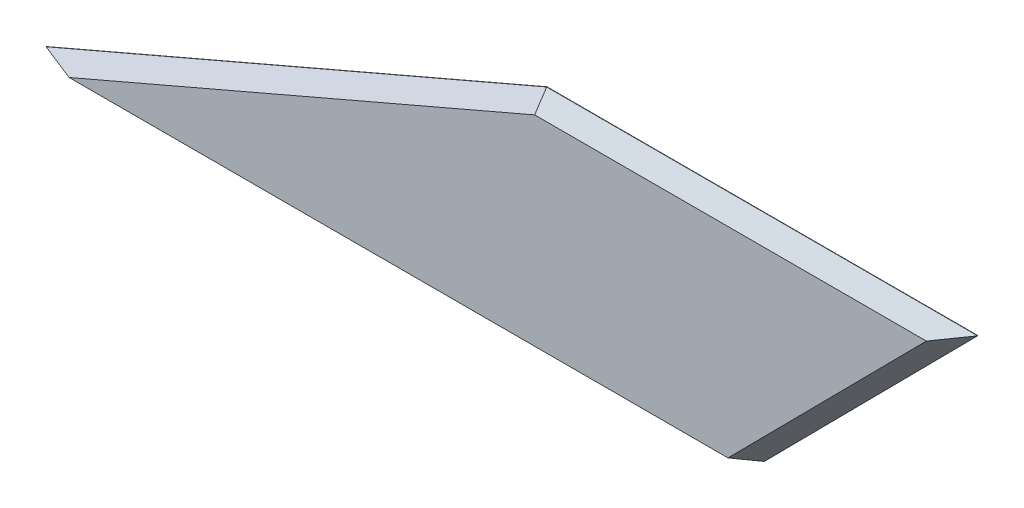
ISO-10303-21;
HEADER;
FILE_DESCRIPTION(('STEP AP214'),'2;1');
FILE_NAME('part.step','',(''),(''),'','','');
FILE_SCHEMA(('AUTOMOTIVE_DESIGN { 1 0 10303 214 1 1 1 1 }'));
ENDSEC;
DATA;
#1=APPLICATION_CONTEXT('core data for automotive mechanical design processes');
#2=APPLICATION_PROTOCOL_DEFINITION('international standard','automotive_design',2000,#1);
#3=PRODUCT_CONTEXT('',#1,'mechanical');
#4=PRODUCT('Part','Part','',(#3));
#5=PRODUCT_RELATED_PRODUCT_CATEGORY('part','',(#4));
#6=PRODUCT_DEFINITION_FORMATION('','',#4);
#7=PRODUCT_DEFINITION_CONTEXT('part definition',#1,'design');
#8=PRODUCT_DEFINITION('design','',#6,#7);
#9=PRODUCT_DEFINITION_SHAPE('','',#8);
#10=(LENGTH_UNIT() NAMED_UNIT(*) SI_UNIT(.MILLI.,.METRE.));
#11=(NAMED_UNIT(*) PLANE_ANGLE_UNIT() SI_UNIT($,.RADIAN.));
#12=(NAMED_UNIT(*) SI_UNIT($,.STERADIAN.) SOLID_ANGLE_UNIT());
#13=UNCERTAINTY_MEASURE_WITH_UNIT(LENGTH_MEASURE(1.E-05),#10,'distance_accuracy_value','');
#14=(GEOMETRIC_REPRESENTATION_CONTEXT(3) GLOBAL_UNCERTAINTY_ASSIGNED_CONTEXT((#13)) GLOBAL_UNIT_ASSIGNED_CONTEXT((#10,
#11,#12)) REPRESENTATION_CONTEXT('',''));
#15=CARTESIAN_POINT('',(0.,0.,0.));
#16=DIRECTION('',(0.,0.,1.));
#17=DIRECTION('',(1.,0.,0.));
#18=AXIS2_PLACEMENT_3D('',#15,#16,#17);
#19=CARTESIAN_POINT('',(69.7,30.,2.125));
#20=DIRECTION('',(0.395350261480131,-0.918530440838839,0.));
#21=DIRECTION('',(0.918530440838839,0.395350261480131,0.));
#22=AXIS2_PLACEMENT_3D('',#19,#20,#21);
#23=PLANE('',#22);
#24=DIRECTION('',(0.,0.,-1.));
#25=VECTOR('',#24,1.);
#26=CARTESIAN_POINT('',(69.7,30.,2.125));
#27=LINE('',#26,#25);
#28=CARTESIAN_POINT('',(69.7,30.,0.0249999999999695));
#29=VERTEX_POINT('',#28);
#30=CARTESIAN_POINT('',(69.7,30.,-0.0250000000000185));
#31=VERTEX_POINT('',#30);
#32=EDGE_CURVE('E121',#29,#31,#27,.T.);
#33=ORIENTED_EDGE('',*,*,#32,.T.);
#34=DIRECTION('',(-0.918530440838839,-0.395350261480131,0.));
#35=VECTOR('',#34,1.);
#36=CARTESIAN_POINT('',(69.7,30.,-0.0250000000000185));
#37=LINE('',#36,#35);
#38=CARTESIAN_POINT('',(0.,0.,-0.0250000000000185));
#39=VERTEX_POINT('',#38);
#40=EDGE_CURVE('E163',#31,#39,#37,.T.);
#41=ORIENTED_EDGE('',*,*,#40,.T.);
#42=DIRECTION('',(0.,0.,-1.));
#43=VECTOR('',#42,1.);
#44=CARTESIAN_POINT('',(0.,0.,2.125));
#45=LINE('',#44,#43);
#46=CARTESIAN_POINT('',(0.,0.,0.0249999999999695));
#47=VERTEX_POINT('',#46);
#48=EDGE_CURVE('E144',#47,#39,#45,.T.);
#49=ORIENTED_EDGE('',*,*,#48,.F.);
#50=DIRECTION('',(0.918530440838839,0.395350261480131,0.));
#51=VECTOR('',#50,1.);
#52=CARTESIAN_POINT('',(69.7,30.,0.0249999999999696));
#53=LINE('',#52,#51);
#54=EDGE_CURVE('E166',#47,#29,#53,.T.);
#55=ORIENTED_EDGE('',*,*,#54,.T.);
#56=EDGE_LOOP('',(#33,#41,#49,#55));
#57=FACE_BOUND('',#56,.T.);
#58=ADVANCED_FACE('F46',(#57),#23,.F.);
#59=CARTESIAN_POINT('',(0.,0.,2.125));
#60=DIRECTION('',(0.,1.,0.));
#61=DIRECTION('',(0.,0.,1.));
#62=AXIS2_PLACEMENT_3D('',#59,#60,#61);
#63=PLANE('',#62);
#64=CARTESIAN_POINT('',(73.,0.,0.));
#65=DIRECTION('',(0.,1.,0.));
#66=DIRECTION('',(0.,0.,1.));
#67=AXIS2_PLACEMENT_3D('',#64,#65,#66);
#68=CIRCLE('',#67,2.);
#69=CARTESIAN_POINT('',(73.,0.,1.99999999999999));
#70=VERTEX_POINT('',#69);
#71=EDGE_CURVE('E192',#70,#70,#68,.F.);
#72=ORIENTED_EDGE('',*,*,#71,.F.);
#73=EDGE_LOOP('',(#72));
#74=FACE_BOUND('',#73,.T.);
#75=DIRECTION('',(1.,0.,0.));
#76=VECTOR('',#75,1.);
#77=CARTESIAN_POINT('',(0.,0.,-2.125));
#78=LINE('',#77,#76);
#79=CARTESIAN_POINT('',(5.31174556996094,0.,-2.125));
#80=VERTEX_POINT('',#79);
#81=CARTESIAN_POINT('',(97.0449634520027,0.,-2.125));
#82=VERTEX_POINT('',#81);
#83=EDGE_CURVE('E196',#80,#82,#78,.T.);
#84=ORIENTED_EDGE('',*,*,#83,.T.);
#85=DIRECTION('',(-0.815132376106786,0.,-0.579274727070417));
#86=VECTOR('',#85,1.);
#87=CARTESIAN_POINT('',(100.,0.,-0.0250000000000233));
#88=LINE('',#87,#86);
#89=CARTESIAN_POINT('',(100.,0.,-0.0250000000000207));
#90=VERTEX_POINT('',#89);
#91=EDGE_CURVE('E127',#82,#90,#88,.F.);
#92=ORIENTED_EDGE('',*,*,#91,.T.);
#93=DIRECTION('',(0.,0.,-1.));
#94=VECTOR('',#93,1.);
#95=CARTESIAN_POINT('',(100.,0.,2.125));
#96=LINE('',#95,#94);
#97=CARTESIAN_POINT('',(100.,0.,0.0249999999999643));
#98=VERTEX_POINT('',#97);
#99=EDGE_CURVE('E138',#98,#90,#96,.T.);
#100=ORIENTED_EDGE('',*,*,#99,.F.);
#101=DIRECTION('',(-0.815132376106786,0.,0.579274727070417));
#102=VECTOR('',#101,1.);
#103=CARTESIAN_POINT('',(65.1286624287795,0.,24.8063547176573));
#104=LINE('',#103,#102);
#105=CARTESIAN_POINT('',(97.0449634520026,0.,2.125));
#106=VERTEX_POINT('',#105);
#107=EDGE_CURVE('E142',#98,#106,#104,.T.);
#108=ORIENTED_EDGE('',*,*,#107,.T.);
#109=DIRECTION('',(1.,0.,0.));
#110=VECTOR('',#109,1.);
#111=CARTESIAN_POINT('',(0.,0.,2.125));
#112=LINE('',#111,#110);
#113=CARTESIAN_POINT('',(5.31174556996103,0.,2.125));
#114=VERTEX_POINT('',#113);
#115=EDGE_CURVE('E204',#114,#106,#112,.T.);
#116=ORIENTED_EDGE('',*,*,#115,.F.);
#117=DIRECTION('',(-0.929960267310424,0.,-0.367660034847311));
#118=VECTOR('',#117,1.);
#119=CARTESIAN_POINT('',(1.43601874200107,0.,0.592730385140462));
#120=LINE('',#119,#118);
#121=EDGE_CURVE('E178',#114,#47,#120,.T.);
#122=ORIENTED_EDGE('',*,*,#121,.T.);
#123=ORIENTED_EDGE('',*,*,#48,.T.);
#124=DIRECTION('',(-0.929960267310425,0.,0.367660034847307));
#125=VECTOR('',#124,1.);
#126=CARTESIAN_POINT('',(60.2783790846925,0.,-23.8560729327316));
#127=LINE('',#126,#125);
#128=EDGE_CURVE('E173',#39,#80,#127,.F.);
#129=ORIENTED_EDGE('',*,*,#128,.T.);
#130=EDGE_LOOP('',(#84,#92,#100,#108,#116,#122,#123,#129));
#131=FACE_BOUND('',#130,.T.);
#132=ADVANCED_FACE('F224',(#74,#131),#63,.F.);
#133=CARTESIAN_POINT('',(100.,0.,2.125));
#134=DIRECTION('',(-0.710651109010208,0.703544597920105,0.));
#135=DIRECTION('',(-0.703544597920105,-0.710651109010208,0.));
#136=AXIS2_PLACEMENT_3D('',#133,#134,#135);
#137=PLANE('',#136);
#138=ORIENTED_EDGE('',*,*,#99,.T.);
#139=DIRECTION('',(0.703544597920105,0.710651109010208,0.));
#140=VECTOR('',#139,1.);
#141=CARTESIAN_POINT('',(100.,0.,-0.0250000000000207));
#142=LINE('',#141,#140);
#143=CARTESIAN_POINT('',(129.7,30.,-0.0250000000000233));
#144=VERTEX_POINT('',#143);
#145=EDGE_CURVE('E136',#90,#144,#142,.T.);
#146=ORIENTED_EDGE('',*,*,#145,.T.);
#147=DIRECTION('',(0.,0.,-1.));
#148=VECTOR('',#147,1.);
#149=CARTESIAN_POINT('',(129.7,30.,2.125));
#150=LINE('',#149,#148);
#151=CARTESIAN_POINT('',(129.7,30.,0.0249999999999673));
#152=VERTEX_POINT('',#151);
#153=EDGE_CURVE('E119',#152,#144,#150,.T.);
#154=ORIENTED_EDGE('',*,*,#153,.F.);
#155=DIRECTION('',(-0.703544597920105,-0.710651109010208,0.));
#156=VECTOR('',#155,1.);
#157=CARTESIAN_POINT('',(100.,0.,0.0249999999999641));
#158=LINE('',#157,#156);
#159=EDGE_CURVE('E133',#152,#98,#158,.T.);
#160=ORIENTED_EDGE('',*,*,#159,.T.);
#161=EDGE_LOOP('',(#138,#146,#154,#160));
#162=FACE_BOUND('',#161,.T.);
#163=ADVANCED_FACE('F132',(#162),#137,.F.);
#164=CARTESIAN_POINT('',(129.7,30.,2.125));
#165=DIRECTION('',(0.,-1.,0.));
#166=DIRECTION('',(1.,0.,0.));
#167=AXIS2_PLACEMENT_3D('',#164,#165,#166);
#168=PLANE('',#167);
#169=ORIENTED_EDGE('',*,*,#153,.T.);
#170=DIRECTION('',(-1.,0.,0.));
#171=VECTOR('',#170,1.);
#172=CARTESIAN_POINT('',(129.7,30.,-0.0250000000000233));
#173=LINE('',#172,#171);
#174=EDGE_CURVE('E126',#144,#31,#173,.T.);
#175=ORIENTED_EDGE('',*,*,#174,.T.);
#176=ORIENTED_EDGE('',*,*,#32,.F.);
#177=DIRECTION('',(1.,0.,0.));
#178=VECTOR('',#177,1.);
#179=CARTESIAN_POINT('',(129.7,30.,0.0249999999999673));
#180=LINE('',#179,#178);
#181=EDGE_CURVE('E116',#29,#152,#180,.T.);
#182=ORIENTED_EDGE('',*,*,#181,.T.);
#183=EDGE_LOOP('',(#169,#175,#176,#182));
#184=FACE_BOUND('',#183,.T.);
#185=ADVANCED_FACE('F118',(#184),#168,.F.);
#186=CARTESIAN_POINT('',(0.,0.,2.125));
#187=DIRECTION('',(0.,0.,1.));
#188=DIRECTION('',(1.,0.,0.));
#189=AXIS2_PLACEMENT_3D('',#186,#187,#188);
#190=PLANE('',#189);
#191=ORIENTED_EDGE('',*,*,#115,.T.);
#192=DIRECTION('',(0.703544597920105,0.710651109010208,0.));
#193=VECTOR('',#192,1.);
#194=CARTESIAN_POINT('',(128.207632671079,31.4774436556322,2.125));
#195=LINE('',#194,#193);
#196=CARTESIAN_POINT('',(124.665963452003,27.9,2.125));
#197=VERTEX_POINT('',#196);
#198=EDGE_CURVE('E11',#106,#197,#195,.T.);
#199=ORIENTED_EDGE('',*,*,#198,.T.);
#200=DIRECTION('',(-1.,0.,0.));
#201=VECTOR('',#200,1.);
#202=CARTESIAN_POINT('',(69.7,27.9,2.125));
#203=LINE('',#202,#201);
#204=CARTESIAN_POINT('',(70.132745569961,27.9,2.125));
#205=VERTEX_POINT('',#204);
#206=EDGE_CURVE('E57',#197,#205,#203,.T.);
#207=ORIENTED_EDGE('',*,*,#206,.T.);
#208=DIRECTION('',(-0.918530440838839,-0.395350261480131,0.));
#209=VECTOR('',#208,1.);
#210=CARTESIAN_POINT('',(0.830235549108285,-1.92891392576158,2.125));
#211=LINE('',#210,#209);
#212=EDGE_CURVE('E160',#205,#114,#211,.T.);
#213=ORIENTED_EDGE('',*,*,#212,.T.);
#214=EDGE_LOOP('',(#191,#199,#207,#213));
#215=FACE_BOUND('',#214,.T.);
#216=ADVANCED_FACE('F249',(#215),#190,.T.);
#217=CARTESIAN_POINT('',(0.,0.,-2.125));
#218=DIRECTION('',(0.,0.,1.));
#219=DIRECTION('',(1.,0.,0.));
#220=AXIS2_PLACEMENT_3D('',#217,#218,#219);
#221=PLANE('',#220);
#222=DIRECTION('',(1.,0.,0.));
#223=VECTOR('',#222,1.);
#224=CARTESIAN_POINT('',(0.,27.9,-2.125));
#225=LINE('',#224,#223);
#226=CARTESIAN_POINT('',(70.132745569961,27.9,-2.125));
#227=VERTEX_POINT('',#226);
#228=CARTESIAN_POINT('',(124.665963452003,27.9,-2.125));
#229=VERTEX_POINT('',#228);
#230=EDGE_CURVE('E184',#227,#229,#225,.T.);
#231=ORIENTED_EDGE('',*,*,#230,.T.);
#232=DIRECTION('',(-0.703544597920105,-0.710651109010208,0.));
#233=VECTOR('',#232,1.);
#234=CARTESIAN_POINT('',(49.0101325448224,-48.5200312193741,-2.125));
#235=LINE('',#234,#233);
#236=EDGE_CURVE('E181',#229,#82,#235,.T.);
#237=ORIENTED_EDGE('',*,*,#236,.T.);
#238=ORIENTED_EDGE('',*,*,#83,.F.);
#239=DIRECTION('',(0.918530440838839,0.395350261480131,0.));
#240=VECTOR('',#239,1.);
#241=CARTESIAN_POINT('',(0.830235549108271,-1.92891392576155,-2.125));
#242=LINE('',#241,#240);
#243=EDGE_CURVE('E187',#80,#227,#242,.T.);
#244=ORIENTED_EDGE('',*,*,#243,.T.);
#245=EDGE_LOOP('',(#231,#237,#238,#244));
#246=FACE_BOUND('',#245,.T.);
#247=ADVANCED_FACE('F220',(#246),#221,.F.);
#248=CARTESIAN_POINT('',(73.,-1.2E-05,0.));
#249=DIRECTION('',(0.,1.,0.));
#250=DIRECTION('',(0.,0.,1.));
#251=AXIS2_PLACEMENT_3D('',#248,#249,#250);
#252=CYLINDRICAL_SURFACE('',#251,2.);
#253=CARTESIAN_POINT('',(73.,10.,0.));
#254=DIRECTION('',(0.,-1.,0.));
#255=DIRECTION('',(0.,0.,-1.));
#256=AXIS2_PLACEMENT_3D('',#253,#254,#255);
#257=CIRCLE('',#256,2.);
#258=CARTESIAN_POINT('',(73.,10.,-2.));
#259=VERTEX_POINT('',#258);
#260=EDGE_CURVE('E155',#259,#259,#257,.T.);
#261=ORIENTED_EDGE('',*,*,#260,.F.);
#262=EDGE_LOOP('',(#261));
#263=FACE_BOUND('',#262,.T.);
#264=ORIENTED_EDGE('',*,*,#71,.T.);
#265=EDGE_LOOP('',(#264));
#266=FACE_BOUND('',#265,.T.);
#267=ADVANCED_FACE('F217',(#263,#266),#252,.F.);
#268=CARTESIAN_POINT('',(73.,10.,0.));
#269=DIRECTION('',(0.,-1.,0.));
#270=DIRECTION('',(0.,0.,-1.));
#271=AXIS2_PLACEMENT_3D('',#268,#269,#270);
#272=PLANE('',#271);
#273=ORIENTED_EDGE('',*,*,#260,.T.);
#274=EDGE_LOOP('',(#273));
#275=FACE_BOUND('',#274,.T.);
#276=ADVANCED_FACE('F215',(#275),#272,.T.);
#277=CARTESIAN_POINT('',(69.7,30.,-0.0250000000000233));
#278=DIRECTION('',(0.279554850836475,-0.64949910344341,0.707106781186549));
#279=DIRECTION('',(-0.918530440838839,-0.395350261480131,0.));
#280=AXIS2_PLACEMENT_3D('',#277,#278,#279);
#281=PLANE('',#280);
#282=ORIENTED_EDGE('',*,*,#128,.F.);
#283=ORIENTED_EDGE('',*,*,#40,.F.);
#284=DIRECTION('',(0.14419030839552,-0.699717498339438,-0.699717498339439));
#285=VECTOR('',#284,1.);
#286=CARTESIAN_POINT('',(69.7,30.,-0.0250000000000233));
#287=LINE('',#286,#285);
#288=EDGE_CURVE('E151',#227,#31,#287,.F.);
#289=ORIENTED_EDGE('',*,*,#288,.F.);
#290=ORIENTED_EDGE('',*,*,#243,.F.);
#291=EDGE_LOOP('',(#282,#283,#289,#290));
#292=FACE_BOUND('',#291,.T.);
#293=ADVANCED_FACE('F247',(#292),#281,.F.);
#294=CARTESIAN_POINT('',(129.7,30.,-0.0250000000000233));
#295=DIRECTION('',(0.,-0.707106781186548,0.707106781186547));
#296=DIRECTION('',(-1.,0.,0.));
#297=AXIS2_PLACEMENT_3D('',#294,#295,#296);
#298=PLANE('',#297);
#299=ORIENTED_EDGE('',*,*,#288,.T.);
#300=ORIENTED_EDGE('',*,*,#174,.F.);
#301=DIRECTION('',(-0.861286710104653,-0.359294588740982,-0.359294588740983));
#302=VECTOR('',#301,1.);
#303=CARTESIAN_POINT('',(129.7,30.,-0.0250000000000222));
#304=LINE('',#303,#302);
#305=EDGE_CURVE('E149',#229,#144,#304,.F.);
#306=ORIENTED_EDGE('',*,*,#305,.F.);
#307=ORIENTED_EDGE('',*,*,#230,.F.);
#308=EDGE_LOOP('',(#299,#300,#306,#307));
#309=FACE_BOUND('',#308,.T.);
#310=ADVANCED_FACE('F240',(#309),#298,.F.);
#311=CARTESIAN_POINT('',(100.,0.,-0.0250000000000233));
#312=DIRECTION('',(-0.50250621823886,0.497481156056471,0.707106781186545));
#313=DIRECTION('',(0.703544597920105,0.710651109010208,0.));
#314=AXIS2_PLACEMENT_3D('',#311,#312,#313);
#315=PLANE('',#314);
#316=ORIENTED_EDGE('',*,*,#91,.F.);
#317=ORIENTED_EDGE('',*,*,#236,.F.);
#318=ORIENTED_EDGE('',*,*,#305,.T.);
#319=ORIENTED_EDGE('',*,*,#145,.F.);
#320=EDGE_LOOP('',(#316,#317,#318,#319));
#321=FACE_BOUND('',#320,.T.);
#322=ADVANCED_FACE('F235',(#321),#315,.F.);
#323=CARTESIAN_POINT('',(0.830235549108285,-1.92891392576158,2.125));
#324=DIRECTION('',(-0.279554850836476,0.649499103443413,0.707106781186546));
#325=DIRECTION('',(0.918530440838839,0.395350261480131,0.));
#326=AXIS2_PLACEMENT_3D('',#323,#324,#325);
#327=PLANE('',#326);
#328=ORIENTED_EDGE('',*,*,#121,.F.);
#329=ORIENTED_EDGE('',*,*,#212,.F.);
#330=DIRECTION('',(-0.144190308395508,0.699717498339438,-0.699717498339442));
#331=VECTOR('',#330,1.);
#332=CARTESIAN_POINT('',(71.7014009811823,20.2877294368101,9.73727056318996));
#333=LINE('',#332,#331);
#334=EDGE_CURVE('E51',#29,#205,#333,.F.);
#335=ORIENTED_EDGE('',*,*,#334,.F.);
#336=ORIENTED_EDGE('',*,*,#54,.F.);
#337=EDGE_LOOP('',(#328,#329,#335,#336));
#338=FACE_BOUND('',#337,.T.);
#339=ADVANCED_FACE('F49',(#338),#327,.T.);
#340=CARTESIAN_POINT('',(0.,27.9,2.125));
#341=DIRECTION('',(0.,0.70710678118655,0.707106781186545));
#342=DIRECTION('',(1.,0.,0.));
#343=AXIS2_PLACEMENT_3D('',#340,#341,#342);
#344=PLANE('',#343);
#345=ORIENTED_EDGE('',*,*,#334,.T.);
#346=ORIENTED_EDGE('',*,*,#206,.F.);
#347=DIRECTION('',(0.861286710104653,0.359294588740982,-0.359294588740984));
#348=VECTOR('',#347,1.);
#349=CARTESIAN_POINT('',(32.1869070806848,-10.6785872883716,40.7035872883717));
#350=LINE('',#349,#348);
#351=EDGE_CURVE('E65',#152,#197,#350,.F.);
#352=ORIENTED_EDGE('',*,*,#351,.F.);
#353=ORIENTED_EDGE('',*,*,#181,.F.);
#354=EDGE_LOOP('',(#345,#346,#352,#353));
#355=FACE_BOUND('',#354,.T.);
#356=ADVANCED_FACE('F146',(#355),#344,.T.);
#357=CARTESIAN_POINT('',(49.0101325448223,-48.5200312193741,2.125));
#358=DIRECTION('',(0.50250621823886,-0.497481156056471,0.707106781186545));
#359=DIRECTION('',(-0.703544597920105,-0.710651109010208,0.));
#360=AXIS2_PLACEMENT_3D('',#357,#358,#359);
#361=PLANE('',#360);
#362=ORIENTED_EDGE('',*,*,#107,.F.);
#363=ORIENTED_EDGE('',*,*,#159,.F.);
#364=ORIENTED_EDGE('',*,*,#351,.T.);
#365=ORIENTED_EDGE('',*,*,#198,.F.);
#366=EDGE_LOOP('',(#362,#363,#364,#365));
#367=FACE_BOUND('',#366,.T.);
#368=ADVANCED_FACE('F141',(#367),#361,.T.);
#369=CLOSED_SHELL('',(#58,#132,#163,#185,#216,#247,#267,#276,#293,#310,#322,#339,#356,#368));
#370=MANIFOLD_SOLID_BREP('B2',#369);
#371=ADVANCED_BREP_SHAPE_REPRESENTATION('',(#18,#370),#14);
#372=SHAPE_DEFINITION_REPRESENTATION(#9,#371);
ENDSEC;
END-ISO-10303-21;
